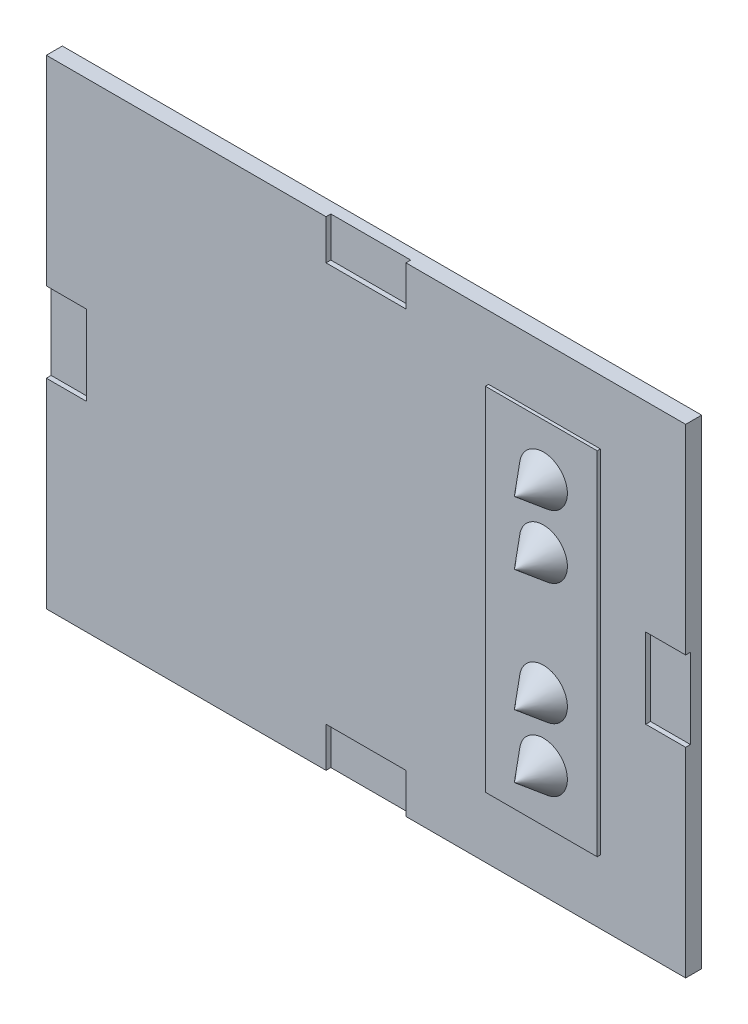
ISO-10303-21;
HEADER;
FILE_DESCRIPTION(('STEP AP214'),'2;1');
FILE_NAME('part.step','',(''),(''),'','','');
FILE_SCHEMA(('AUTOMOTIVE_DESIGN { 1 0 10303 214 1 1 1 1 }'));
ENDSEC;
DATA;
#1=APPLICATION_CONTEXT('core data for automotive mechanical design processes');
#2=APPLICATION_PROTOCOL_DEFINITION('international standard','automotive_design',2000,#1);
#3=PRODUCT_CONTEXT('',#1,'mechanical');
#4=PRODUCT('Part','Part','',(#3));
#5=PRODUCT_RELATED_PRODUCT_CATEGORY('part','',(#4));
#6=PRODUCT_DEFINITION_FORMATION('','',#4);
#7=PRODUCT_DEFINITION_CONTEXT('part definition',#1,'design');
#8=PRODUCT_DEFINITION('design','',#6,#7);
#9=PRODUCT_DEFINITION_SHAPE('','',#8);
#10=(LENGTH_UNIT() NAMED_UNIT(*) SI_UNIT(.MILLI.,.METRE.));
#11=(NAMED_UNIT(*) PLANE_ANGLE_UNIT() SI_UNIT($,.RADIAN.));
#12=(NAMED_UNIT(*) SI_UNIT($,.STERADIAN.) SOLID_ANGLE_UNIT());
#13=UNCERTAINTY_MEASURE_WITH_UNIT(LENGTH_MEASURE(1.E-05),#10,'distance_accuracy_value','');
#14=(GEOMETRIC_REPRESENTATION_CONTEXT(3) GLOBAL_UNCERTAINTY_ASSIGNED_CONTEXT((#13)) GLOBAL_UNIT_ASSIGNED_CONTEXT((#10,
#11,#12)) REPRESENTATION_CONTEXT('',''));
#15=CARTESIAN_POINT('',(0.,0.,0.));
#16=DIRECTION('',(0.,0.,1.));
#17=DIRECTION('',(1.,0.,0.));
#18=AXIS2_PLACEMENT_3D('',#15,#16,#17);
#19=CARTESIAN_POINT('',(-20.,15.,1.));
#20=DIRECTION('',(1.,0.,0.));
#21=DIRECTION('',(0.,0.,-1.));
#22=AXIS2_PLACEMENT_3D('',#19,#20,#21);
#23=PLANE('',#22);
#24=DIRECTION('',(0.,-1.,0.));
#25=VECTOR('',#24,1.);
#26=CARTESIAN_POINT('',(-20.,2.5,0.7));
#27=LINE('',#26,#25);
#28=CARTESIAN_POINT('',(-20.,2.5,0.7));
#29=VERTEX_POINT('',#28);
#30=CARTESIAN_POINT('',(-20.,-2.5,0.7));
#31=VERTEX_POINT('',#30);
#32=EDGE_CURVE('E200',#29,#31,#27,.T.);
#33=ORIENTED_EDGE('',*,*,#32,.F.);
#34=DIRECTION('',(0.,0.,1.));
#35=VECTOR('',#34,1.);
#36=CARTESIAN_POINT('',(-20.,2.5,0.7));
#37=LINE('',#36,#35);
#38=CARTESIAN_POINT('',(-20.,2.5,1.));
#39=VERTEX_POINT('',#38);
#40=EDGE_CURVE('E295',#29,#39,#37,.T.);
#41=ORIENTED_EDGE('',*,*,#40,.T.);
#42=DIRECTION('',(0.,-1.,0.));
#43=VECTOR('',#42,1.);
#44=CARTESIAN_POINT('',(-20.,15.,1.));
#45=LINE('',#44,#43);
#46=CARTESIAN_POINT('',(-20.,15.,1.));
#47=VERTEX_POINT('',#46);
#48=EDGE_CURVE('E341',#47,#39,#45,.T.);
#49=ORIENTED_EDGE('',*,*,#48,.F.);
#50=DIRECTION('',(0.,0.,-1.));
#51=VECTOR('',#50,1.);
#52=CARTESIAN_POINT('',(-20.,15.,1.));
#53=LINE('',#52,#51);
#54=CARTESIAN_POINT('',(-20.,15.,0.));
#55=VERTEX_POINT('',#54);
#56=EDGE_CURVE('E356',#47,#55,#53,.T.);
#57=ORIENTED_EDGE('',*,*,#56,.T.);
#58=DIRECTION('',(0.,-1.,0.));
#59=VECTOR('',#58,1.);
#60=CARTESIAN_POINT('',(-20.,15.,0.));
#61=LINE('',#60,#59);
#62=CARTESIAN_POINT('',(-20.,-15.,0.));
#63=VERTEX_POINT('',#62);
#64=EDGE_CURVE('E340',#55,#63,#61,.T.);
#65=ORIENTED_EDGE('',*,*,#64,.T.);
#66=DIRECTION('',(0.,0.,-1.));
#67=VECTOR('',#66,1.);
#68=CARTESIAN_POINT('',(-20.,-15.,1.));
#69=LINE('',#68,#67);
#70=CARTESIAN_POINT('',(-20.,-15.,1.));
#71=VERTEX_POINT('',#70);
#72=EDGE_CURVE('E373',#71,#63,#69,.T.);
#73=ORIENTED_EDGE('',*,*,#72,.F.);
#74=CARTESIAN_POINT('',(-20.,-2.5,1.));
#75=VERTEX_POINT('',#74);
#76=EDGE_CURVE('E213',#75,#71,#45,.T.);
#77=ORIENTED_EDGE('',*,*,#76,.F.);
#78=DIRECTION('',(0.,0.,1.));
#79=VECTOR('',#78,1.);
#80=CARTESIAN_POINT('',(-20.,-2.5,0.7));
#81=LINE('',#80,#79);
#82=EDGE_CURVE('E46',#31,#75,#81,.T.);
#83=ORIENTED_EDGE('',*,*,#82,.F.);
#84=EDGE_LOOP('',(#33,#41,#49,#57,#65,#73,#77,#83));
#85=FACE_BOUND('',#84,.T.);
#86=ADVANCED_FACE('F32',(#85),#23,.F.);
#87=CARTESIAN_POINT('',(-20.,-15.,1.));
#88=DIRECTION('',(0.,1.,0.));
#89=DIRECTION('',(0.,0.,1.));
#90=AXIS2_PLACEMENT_3D('',#87,#88,#89);
#91=PLANE('',#90);
#92=DIRECTION('',(1.,0.,0.));
#93=VECTOR('',#92,1.);
#94=CARTESIAN_POINT('',(-20.,-15.,1.));
#95=LINE('',#94,#93);
#96=CARTESIAN_POINT('',(2.5,-15.,1.));
#97=VERTEX_POINT('',#96);
#98=CARTESIAN_POINT('',(20.,-15.,1.));
#99=VERTEX_POINT('',#98);
#100=EDGE_CURVE('E344',#97,#99,#95,.T.);
#101=ORIENTED_EDGE('',*,*,#100,.F.);
#102=DIRECTION('',(0.,0.,1.));
#103=VECTOR('',#102,1.);
#104=CARTESIAN_POINT('',(2.5,-15.,0.7));
#105=LINE('',#104,#103);
#106=CARTESIAN_POINT('',(2.5,-15.,0.7));
#107=VERTEX_POINT('',#106);
#108=EDGE_CURVE('E299',#107,#97,#105,.T.);
#109=ORIENTED_EDGE('',*,*,#108,.F.);
#110=DIRECTION('',(1.,0.,0.));
#111=VECTOR('',#110,1.);
#112=CARTESIAN_POINT('',(-2.5,-15.,0.7));
#113=LINE('',#112,#111);
#114=CARTESIAN_POINT('',(-2.5,-15.,0.7));
#115=VERTEX_POINT('',#114);
#116=EDGE_CURVE('E288',#115,#107,#113,.T.);
#117=ORIENTED_EDGE('',*,*,#116,.F.);
#118=DIRECTION('',(0.,0.,1.));
#119=VECTOR('',#118,1.);
#120=CARTESIAN_POINT('',(-2.5,-15.,0.7));
#121=LINE('',#120,#119);
#122=CARTESIAN_POINT('',(-2.5,-15.,1.));
#123=VERTEX_POINT('',#122);
#124=EDGE_CURVE('E302',#115,#123,#121,.T.);
#125=ORIENTED_EDGE('',*,*,#124,.T.);
#126=EDGE_CURVE('E345',#71,#123,#95,.T.);
#127=ORIENTED_EDGE('',*,*,#126,.F.);
#128=ORIENTED_EDGE('',*,*,#72,.T.);
#129=DIRECTION('',(1.,0.,0.));
#130=VECTOR('',#129,1.);
#131=CARTESIAN_POINT('',(-20.,-15.,0.));
#132=LINE('',#131,#130);
#133=CARTESIAN_POINT('',(20.,-15.,0.));
#134=VERTEX_POINT('',#133);
#135=EDGE_CURVE('E359',#63,#134,#132,.T.);
#136=ORIENTED_EDGE('',*,*,#135,.T.);
#137=DIRECTION('',(0.,0.,-1.));
#138=VECTOR('',#137,1.);
#139=CARTESIAN_POINT('',(20.,-15.,1.));
#140=LINE('',#139,#138);
#141=EDGE_CURVE('E371',#99,#134,#140,.T.);
#142=ORIENTED_EDGE('',*,*,#141,.F.);
#143=EDGE_LOOP('',(#101,#109,#117,#125,#127,#128,#136,#142));
#144=FACE_BOUND('',#143,.T.);
#145=ADVANCED_FACE('F431',(#144),#91,.F.);
#146=CARTESIAN_POINT('',(20.,15.,1.));
#147=DIRECTION('',(1.,0.,0.));
#148=DIRECTION('',(0.,0.,-1.));
#149=AXIS2_PLACEMENT_3D('',#146,#147,#148);
#150=PLANE('',#149);
#151=DIRECTION('',(0.,0.,1.));
#152=VECTOR('',#151,1.);
#153=CARTESIAN_POINT('',(20.,-2.5,0.7));
#154=LINE('',#153,#152);
#155=CARTESIAN_POINT('',(20.,-2.5,0.7));
#156=VERTEX_POINT('',#155);
#157=CARTESIAN_POINT('',(20.,-2.5,1.));
#158=VERTEX_POINT('',#157);
#159=EDGE_CURVE('E237',#156,#158,#154,.T.);
#160=ORIENTED_EDGE('',*,*,#159,.T.);
#161=DIRECTION('',(0.,-1.,0.));
#162=VECTOR('',#161,1.);
#163=CARTESIAN_POINT('',(20.,15.,1.));
#164=LINE('',#163,#162);
#165=EDGE_CURVE('E348',#158,#99,#164,.T.);
#166=ORIENTED_EDGE('',*,*,#165,.T.);
#167=ORIENTED_EDGE('',*,*,#141,.T.);
#168=DIRECTION('',(0.,-1.,0.));
#169=VECTOR('',#168,1.);
#170=CARTESIAN_POINT('',(20.,15.,0.));
#171=LINE('',#170,#169);
#172=CARTESIAN_POINT('',(20.,15.,0.));
#173=VERTEX_POINT('',#172);
#174=EDGE_CURVE('E362',#173,#134,#171,.T.);
#175=ORIENTED_EDGE('',*,*,#174,.F.);
#176=DIRECTION('',(0.,0.,-1.));
#177=VECTOR('',#176,1.);
#178=CARTESIAN_POINT('',(20.,15.,1.));
#179=LINE('',#178,#177);
#180=CARTESIAN_POINT('',(20.,15.,1.));
#181=VERTEX_POINT('',#180);
#182=EDGE_CURVE('E369',#181,#173,#179,.T.);
#183=ORIENTED_EDGE('',*,*,#182,.F.);
#184=CARTESIAN_POINT('',(20.,2.5,1.));
#185=VERTEX_POINT('',#184);
#186=EDGE_CURVE('E349',#181,#185,#164,.T.);
#187=ORIENTED_EDGE('',*,*,#186,.T.);
#188=DIRECTION('',(0.,0.,1.));
#189=VECTOR('',#188,1.);
#190=CARTESIAN_POINT('',(20.,2.5,0.7));
#191=LINE('',#190,#189);
#192=CARTESIAN_POINT('',(20.,2.5,0.7));
#193=VERTEX_POINT('',#192);
#194=EDGE_CURVE('E262',#193,#185,#191,.T.);
#195=ORIENTED_EDGE('',*,*,#194,.F.);
#196=DIRECTION('',(0.,1.,0.));
#197=VECTOR('',#196,1.);
#198=CARTESIAN_POINT('',(20.,2.5,0.7));
#199=LINE('',#198,#197);
#200=EDGE_CURVE('E249',#156,#193,#199,.T.);
#201=ORIENTED_EDGE('',*,*,#200,.F.);
#202=EDGE_LOOP('',(#160,#166,#167,#175,#183,#187,#195,#201));
#203=FACE_BOUND('',#202,.T.);
#204=ADVANCED_FACE('F425',(#203),#150,.T.);
#205=CARTESIAN_POINT('',(-20.,15.,1.));
#206=DIRECTION('',(0.,1.,0.));
#207=DIRECTION('',(0.,0.,1.));
#208=AXIS2_PLACEMENT_3D('',#205,#206,#207);
#209=PLANE('',#208);
#210=DIRECTION('',(0.,0.,1.));
#211=VECTOR('',#210,1.);
#212=CARTESIAN_POINT('',(2.5,15.,0.7));
#213=LINE('',#212,#211);
#214=CARTESIAN_POINT('',(2.5,15.,0.7));
#215=VERTEX_POINT('',#214);
#216=CARTESIAN_POINT('',(2.5,15.,1.));
#217=VERTEX_POINT('',#216);
#218=EDGE_CURVE('E233',#215,#217,#213,.T.);
#219=ORIENTED_EDGE('',*,*,#218,.T.);
#220=DIRECTION('',(1.,0.,0.));
#221=VECTOR('',#220,1.);
#222=CARTESIAN_POINT('',(-20.,15.,1.));
#223=LINE('',#222,#221);
#224=EDGE_CURVE('E352',#217,#181,#223,.T.);
#225=ORIENTED_EDGE('',*,*,#224,.T.);
#226=ORIENTED_EDGE('',*,*,#182,.T.);
#227=DIRECTION('',(1.,0.,0.));
#228=VECTOR('',#227,1.);
#229=CARTESIAN_POINT('',(-20.,15.,0.));
#230=LINE('',#229,#228);
#231=EDGE_CURVE('E365',#55,#173,#230,.T.);
#232=ORIENTED_EDGE('',*,*,#231,.F.);
#233=ORIENTED_EDGE('',*,*,#56,.F.);
#234=CARTESIAN_POINT('',(-2.5,15.,1.));
#235=VERTEX_POINT('',#234);
#236=EDGE_CURVE('E353',#47,#235,#223,.T.);
#237=ORIENTED_EDGE('',*,*,#236,.T.);
#238=DIRECTION('',(0.,0.,1.));
#239=VECTOR('',#238,1.);
#240=CARTESIAN_POINT('',(-2.5,15.,0.7));
#241=LINE('',#240,#239);
#242=CARTESIAN_POINT('',(-2.5,15.,0.7));
#243=VERTEX_POINT('',#242);
#244=EDGE_CURVE('E54',#243,#235,#241,.T.);
#245=ORIENTED_EDGE('',*,*,#244,.F.);
#246=DIRECTION('',(-1.,0.,0.));
#247=VECTOR('',#246,1.);
#248=CARTESIAN_POINT('',(-2.5,15.,0.7));
#249=LINE('',#248,#247);
#250=EDGE_CURVE('E223',#215,#243,#249,.T.);
#251=ORIENTED_EDGE('',*,*,#250,.F.);
#252=EDGE_LOOP('',(#219,#225,#226,#232,#233,#237,#245,#251));
#253=FACE_BOUND('',#252,.T.);
#254=ADVANCED_FACE('F416',(#253),#209,.T.);
#255=CARTESIAN_POINT('',(0.,0.,1.));
#256=DIRECTION('',(0.,0.,1.));
#257=DIRECTION('',(1.,0.,0.));
#258=AXIS2_PLACEMENT_3D('',#255,#256,#257);
#259=PLANE('',#258);
#260=DIRECTION('',(-1.,0.,0.));
#261=VECTOR('',#260,1.);
#262=CARTESIAN_POINT('',(-17.5,2.5,1.));
#263=LINE('',#262,#261);
#264=CARTESIAN_POINT('',(-17.5,2.5,1.));
#265=VERTEX_POINT('',#264);
#266=EDGE_CURVE('E209',#265,#39,#263,.T.);
#267=ORIENTED_EDGE('',*,*,#266,.F.);
#268=DIRECTION('',(0.,1.,0.));
#269=VECTOR('',#268,1.);
#270=CARTESIAN_POINT('',(-17.5,2.5,1.));
#271=LINE('',#270,#269);
#272=CARTESIAN_POINT('',(-17.5,-2.5,1.));
#273=VERTEX_POINT('',#272);
#274=EDGE_CURVE('E462',#273,#265,#271,.T.);
#275=ORIENTED_EDGE('',*,*,#274,.F.);
#276=DIRECTION('',(1.,0.,0.));
#277=VECTOR('',#276,1.);
#278=CARTESIAN_POINT('',(-17.5,-2.5,1.));
#279=LINE('',#278,#277);
#280=EDGE_CURVE('E243',#75,#273,#279,.T.);
#281=ORIENTED_EDGE('',*,*,#280,.F.);
#282=ORIENTED_EDGE('',*,*,#76,.T.);
#283=ORIENTED_EDGE('',*,*,#126,.T.);
#284=DIRECTION('',(0.,-1.,0.));
#285=VECTOR('',#284,1.);
#286=CARTESIAN_POINT('',(-2.5,-12.5,1.));
#287=LINE('',#286,#285);
#288=CARTESIAN_POINT('',(-2.5,-12.5,1.));
#289=VERTEX_POINT('',#288);
#290=EDGE_CURVE('E282',#289,#123,#287,.T.);
#291=ORIENTED_EDGE('',*,*,#290,.F.);
#292=DIRECTION('',(-1.,0.,0.));
#293=VECTOR('',#292,1.);
#294=CARTESIAN_POINT('',(-2.5,-12.5,1.));
#295=LINE('',#294,#293);
#296=CARTESIAN_POINT('',(2.5,-12.5,1.));
#297=VERTEX_POINT('',#296);
#298=EDGE_CURVE('E294',#297,#289,#295,.T.);
#299=ORIENTED_EDGE('',*,*,#298,.F.);
#300=DIRECTION('',(0.,1.,0.));
#301=VECTOR('',#300,1.);
#302=CARTESIAN_POINT('',(2.5,-12.5,1.));
#303=LINE('',#302,#301);
#304=EDGE_CURVE('E292',#97,#297,#303,.T.);
#305=ORIENTED_EDGE('',*,*,#304,.F.);
#306=ORIENTED_EDGE('',*,*,#100,.T.);
#307=ORIENTED_EDGE('',*,*,#165,.F.);
#308=DIRECTION('',(1.,0.,0.));
#309=VECTOR('',#308,1.);
#310=CARTESIAN_POINT('',(17.5,-2.5,1.));
#311=LINE('',#310,#309);
#312=CARTESIAN_POINT('',(17.5,-2.5,1.));
#313=VERTEX_POINT('',#312);
#314=EDGE_CURVE('E253',#313,#158,#311,.T.);
#315=ORIENTED_EDGE('',*,*,#314,.F.);
#316=DIRECTION('',(0.,-1.,0.));
#317=VECTOR('',#316,1.);
#318=CARTESIAN_POINT('',(17.5,2.5,1.));
#319=LINE('',#318,#317);
#320=CARTESIAN_POINT('',(17.5,2.5,1.));
#321=VERTEX_POINT('',#320);
#322=EDGE_CURVE('E266',#321,#313,#319,.T.);
#323=ORIENTED_EDGE('',*,*,#322,.F.);
#324=DIRECTION('',(-1.,0.,0.));
#325=VECTOR('',#324,1.);
#326=CARTESIAN_POINT('',(17.5,2.5,1.));
#327=LINE('',#326,#325);
#328=EDGE_CURVE('E263',#185,#321,#327,.T.);
#329=ORIENTED_EDGE('',*,*,#328,.F.);
#330=ORIENTED_EDGE('',*,*,#186,.F.);
#331=ORIENTED_EDGE('',*,*,#224,.F.);
#332=DIRECTION('',(0.,1.,0.));
#333=VECTOR('',#332,1.);
#334=CARTESIAN_POINT('',(2.5,15.,1.));
#335=LINE('',#334,#333);
#336=CARTESIAN_POINT('',(2.5,12.5,1.));
#337=VERTEX_POINT('',#336);
#338=EDGE_CURVE('E234',#337,#217,#335,.T.);
#339=ORIENTED_EDGE('',*,*,#338,.F.);
#340=DIRECTION('',(1.,0.,0.));
#341=VECTOR('',#340,1.);
#342=CARTESIAN_POINT('',(-2.5,12.5,1.));
#343=LINE('',#342,#341);
#344=CARTESIAN_POINT('',(-2.5,12.5,1.));
#345=VERTEX_POINT('',#344);
#346=EDGE_CURVE('E224',#345,#337,#343,.T.);
#347=ORIENTED_EDGE('',*,*,#346,.F.);
#348=DIRECTION('',(0.,-1.,0.));
#349=VECTOR('',#348,1.);
#350=CARTESIAN_POINT('',(-2.5,15.,1.));
#351=LINE('',#350,#349);
#352=EDGE_CURVE('E236',#235,#345,#351,.T.);
#353=ORIENTED_EDGE('',*,*,#352,.F.);
#354=ORIENTED_EDGE('',*,*,#236,.F.);
#355=ORIENTED_EDGE('',*,*,#48,.T.);
#356=EDGE_LOOP('',(#267,#275,#281,#282,#283,#291,#299,#305,#306,#307,#315,#323,#329,#330,#331,
#339,#347,#353,#354,#355));
#357=FACE_BOUND('',#356,.T.);
#358=DIRECTION('',(-1.,0.,0.));
#359=VECTOR('',#358,1.);
#360=CARTESIAN_POINT('',(0.,11.,1.));
#361=LINE('',#360,#359);
#362=CARTESIAN_POINT('',(14.6666666666667,11.,1.));
#363=VERTEX_POINT('',#362);
#364=CARTESIAN_POINT('',(7.66666666666667,11.,1.));
#365=VERTEX_POINT('',#364);
#366=EDGE_CURVE('E337',#363,#365,#361,.T.);
#367=ORIENTED_EDGE('',*,*,#366,.F.);
#368=DIRECTION('',(0.,1.,0.));
#369=VECTOR('',#368,1.);
#370=CARTESIAN_POINT('',(14.6666666666667,0.,1.));
#371=LINE('',#370,#369);
#372=CARTESIAN_POINT('',(14.6666666666667,-11.,1.));
#373=VERTEX_POINT('',#372);
#374=EDGE_CURVE('E322',#373,#363,#371,.T.);
#375=ORIENTED_EDGE('',*,*,#374,.F.);
#376=DIRECTION('',(-1.,0.,0.));
#377=VECTOR('',#376,1.);
#378=CARTESIAN_POINT('',(0.,-11.,1.));
#379=LINE('',#378,#377);
#380=CARTESIAN_POINT('',(7.66666666666667,-11.,1.));
#381=VERTEX_POINT('',#380);
#382=EDGE_CURVE('E333',#373,#381,#379,.T.);
#383=ORIENTED_EDGE('',*,*,#382,.T.);
#384=DIRECTION('',(0.,1.,0.));
#385=VECTOR('',#384,1.);
#386=CARTESIAN_POINT('',(7.66666666666667,0.,1.));
#387=LINE('',#386,#385);
#388=EDGE_CURVE('E335',#381,#365,#387,.T.);
#389=ORIENTED_EDGE('',*,*,#388,.T.);
#390=EDGE_LOOP('',(#367,#375,#383,#389));
#391=FACE_BOUND('',#390,.T.);
#392=ADVANCED_FACE('F413',(#357,#391),#259,.T.);
#393=CARTESIAN_POINT('',(0.,0.,0.));
#394=DIRECTION('',(0.,0.,1.));
#395=DIRECTION('',(1.,0.,0.));
#396=AXIS2_PLACEMENT_3D('',#393,#394,#395);
#397=PLANE('',#396);
#398=ORIENTED_EDGE('',*,*,#64,.F.);
#399=ORIENTED_EDGE('',*,*,#231,.T.);
#400=ORIENTED_EDGE('',*,*,#174,.T.);
#401=ORIENTED_EDGE('',*,*,#135,.F.);
#402=EDGE_LOOP('',(#398,#399,#400,#401));
#403=FACE_BOUND('',#402,.T.);
#404=ADVANCED_FACE('F415',(#403),#397,.F.);
#405=CARTESIAN_POINT('',(7.66666666666667,11.,1.2));
#406=DIRECTION('',(0.,1.,0.));
#407=DIRECTION('',(-1.,0.,0.));
#408=AXIS2_PLACEMENT_3D('',#405,#406,#407);
#409=PLANE('',#408);
#410=DIRECTION('',(0.,0.,-1.));
#411=VECTOR('',#410,1.);
#412=CARTESIAN_POINT('',(14.6666666666667,11.,1.2));
#413=LINE('',#412,#411);
#414=CARTESIAN_POINT('',(14.6666666666667,11.,1.2));
#415=VERTEX_POINT('',#414);
#416=EDGE_CURVE('E318',#415,#363,#413,.T.);
#417=ORIENTED_EDGE('',*,*,#416,.T.);
#418=ORIENTED_EDGE('',*,*,#366,.T.);
#419=DIRECTION('',(0.,0.,-1.));
#420=VECTOR('',#419,1.);
#421=CARTESIAN_POINT('',(7.66666666666667,11.,1.2));
#422=LINE('',#421,#420);
#423=CARTESIAN_POINT('',(7.66666666666667,11.,1.2));
#424=VERTEX_POINT('',#423);
#425=EDGE_CURVE('E319',#424,#365,#422,.T.);
#426=ORIENTED_EDGE('',*,*,#425,.F.);
#427=DIRECTION('',(1.,0.,0.));
#428=VECTOR('',#427,1.);
#429=CARTESIAN_POINT('',(7.66666666666667,11.,1.2));
#430=LINE('',#429,#428);
#431=EDGE_CURVE('E301',#424,#415,#430,.T.);
#432=ORIENTED_EDGE('',*,*,#431,.T.);
#433=EDGE_LOOP('',(#417,#418,#426,#432));
#434=FACE_BOUND('',#433,.T.);
#435=ADVANCED_FACE('F402',(#434),#409,.T.);
#436=CARTESIAN_POINT('',(7.66666666666667,11.,1.2));
#437=DIRECTION('',(1.,0.,0.));
#438=DIRECTION('',(0.,1.,0.));
#439=AXIS2_PLACEMENT_3D('',#436,#437,#438);
#440=PLANE('',#439);
#441=ORIENTED_EDGE('',*,*,#388,.F.);
#442=DIRECTION('',(0.,0.,-1.));
#443=VECTOR('',#442,1.);
#444=CARTESIAN_POINT('',(7.66666666666667,-11.,1.2));
#445=LINE('',#444,#443);
#446=CARTESIAN_POINT('',(7.66666666666667,-11.,1.2));
#447=VERTEX_POINT('',#446);
#448=EDGE_CURVE('E323',#447,#381,#445,.T.);
#449=ORIENTED_EDGE('',*,*,#448,.F.);
#450=DIRECTION('',(0.,-1.,0.));
#451=VECTOR('',#450,1.);
#452=CARTESIAN_POINT('',(7.66666666666667,11.,1.2));
#453=LINE('',#452,#451);
#454=EDGE_CURVE('E316',#424,#447,#453,.T.);
#455=ORIENTED_EDGE('',*,*,#454,.F.);
#456=ORIENTED_EDGE('',*,*,#425,.T.);
#457=EDGE_LOOP('',(#441,#449,#455,#456));
#458=FACE_BOUND('',#457,.T.);
#459=ADVANCED_FACE('F405',(#458),#440,.F.);
#460=CARTESIAN_POINT('',(7.66666666666667,-11.,1.2));
#461=DIRECTION('',(0.,1.,0.));
#462=DIRECTION('',(-1.,0.,0.));
#463=AXIS2_PLACEMENT_3D('',#460,#461,#462);
#464=PLANE('',#463);
#465=ORIENTED_EDGE('',*,*,#382,.F.);
#466=DIRECTION('',(0.,0.,-1.));
#467=VECTOR('',#466,1.);
#468=CARTESIAN_POINT('',(14.6666666666667,-11.,1.2));
#469=LINE('',#468,#467);
#470=CARTESIAN_POINT('',(14.6666666666667,-11.,1.2));
#471=VERTEX_POINT('',#470);
#472=EDGE_CURVE('E326',#471,#373,#469,.T.);
#473=ORIENTED_EDGE('',*,*,#472,.F.);
#474=DIRECTION('',(1.,0.,0.));
#475=VECTOR('',#474,1.);
#476=CARTESIAN_POINT('',(7.66666666666667,-11.,1.2));
#477=LINE('',#476,#475);
#478=EDGE_CURVE('E314',#447,#471,#477,.T.);
#479=ORIENTED_EDGE('',*,*,#478,.F.);
#480=ORIENTED_EDGE('',*,*,#448,.T.);
#481=EDGE_LOOP('',(#465,#473,#479,#480));
#482=FACE_BOUND('',#481,.T.);
#483=ADVANCED_FACE('F410',(#482),#464,.F.);
#484=CARTESIAN_POINT('',(14.6666666666667,11.,1.2));
#485=DIRECTION('',(1.,0.,0.));
#486=DIRECTION('',(0.,1.,0.));
#487=AXIS2_PLACEMENT_3D('',#484,#485,#486);
#488=PLANE('',#487);
#489=ORIENTED_EDGE('',*,*,#472,.T.);
#490=ORIENTED_EDGE('',*,*,#374,.T.);
#491=ORIENTED_EDGE('',*,*,#416,.F.);
#492=DIRECTION('',(0.,-1.,0.));
#493=VECTOR('',#492,1.);
#494=CARTESIAN_POINT('',(14.6666666666667,11.,1.2));
#495=LINE('',#494,#493);
#496=EDGE_CURVE('E311',#415,#471,#495,.T.);
#497=ORIENTED_EDGE('',*,*,#496,.T.);
#498=EDGE_LOOP('',(#489,#490,#491,#497));
#499=FACE_BOUND('',#498,.T.);
#500=ADVANCED_FACE('F390',(#499),#488,.T.);
#501=CARTESIAN_POINT('',(0.,0.,1.2));
#502=DIRECTION('',(0.,0.,-1.));
#503=DIRECTION('',(-1.,0.,0.));
#504=AXIS2_PLACEMENT_3D('',#501,#502,#503);
#505=PLANE('',#504);
#506=CARTESIAN_POINT('',(11.3,7.75,1.2));
#507=DIRECTION('',(0.,0.,-1.));
#508=DIRECTION('',(-1.,0.,0.));
#509=AXIS2_PLACEMENT_3D('',#506,#507,#508);
#510=CIRCLE('',#509,1.5);
#511=CARTESIAN_POINT('',(9.8,7.75,1.2));
#512=VERTEX_POINT('',#511);
#513=EDGE_CURVE('E11',#512,#512,#510,.F.);
#514=ORIENTED_EDGE('',*,*,#513,.F.);
#515=EDGE_LOOP('',(#514));
#516=FACE_BOUND('',#515,.T.);
#517=CARTESIAN_POINT('',(11.3,3.8,1.2));
#518=DIRECTION('',(0.,0.,-1.));
#519=DIRECTION('',(-1.,0.,0.));
#520=AXIS2_PLACEMENT_3D('',#517,#518,#519);
#521=CIRCLE('',#520,1.5);
#522=CARTESIAN_POINT('',(9.8,3.8,1.2));
#523=VERTEX_POINT('',#522);
#524=EDGE_CURVE('E39',#523,#523,#521,.F.);
#525=ORIENTED_EDGE('',*,*,#524,.F.);
#526=EDGE_LOOP('',(#525));
#527=FACE_BOUND('',#526,.T.);
#528=CARTESIAN_POINT('',(11.3,-3.8,1.2));
#529=DIRECTION('',(0.,0.,-1.));
#530=DIRECTION('',(-1.,0.,0.));
#531=AXIS2_PLACEMENT_3D('',#528,#529,#530);
#532=CIRCLE('',#531,1.5);
#533=CARTESIAN_POINT('',(9.8,-3.8,1.2));
#534=VERTEX_POINT('',#533);
#535=EDGE_CURVE('E379',#534,#534,#532,.F.);
#536=ORIENTED_EDGE('',*,*,#535,.F.);
#537=EDGE_LOOP('',(#536));
#538=FACE_BOUND('',#537,.T.);
#539=CARTESIAN_POINT('',(11.3,-7.75,1.2));
#540=DIRECTION('',(0.,0.,-1.));
#541=DIRECTION('',(-1.,0.,0.));
#542=AXIS2_PLACEMENT_3D('',#539,#540,#541);
#543=CIRCLE('',#542,1.5);
#544=CARTESIAN_POINT('',(9.8,-7.75,1.2));
#545=VERTEX_POINT('',#544);
#546=EDGE_CURVE('E376',#545,#545,#543,.F.);
#547=ORIENTED_EDGE('',*,*,#546,.F.);
#548=EDGE_LOOP('',(#547));
#549=FACE_BOUND('',#548,.T.);
#550=ORIENTED_EDGE('',*,*,#431,.F.);
#551=ORIENTED_EDGE('',*,*,#454,.T.);
#552=ORIENTED_EDGE('',*,*,#478,.T.);
#553=ORIENTED_EDGE('',*,*,#496,.F.);
#554=EDGE_LOOP('',(#550,#551,#552,#553));
#555=FACE_BOUND('',#554,.T.);
#556=ADVANCED_FACE('F386',(#516,#527,#538,#549,#555),#505,.F.);
#557=CARTESIAN_POINT('',(2.5,-12.5,0.7));
#558=DIRECTION('',(1.,0.,0.));
#559=DIRECTION('',(0.,0.,-1.));
#560=AXIS2_PLACEMENT_3D('',#557,#558,#559);
#561=PLANE('',#560);
#562=ORIENTED_EDGE('',*,*,#304,.T.);
#563=DIRECTION('',(0.,0.,1.));
#564=VECTOR('',#563,1.);
#565=CARTESIAN_POINT('',(2.5,-12.5,0.7));
#566=LINE('',#565,#564);
#567=CARTESIAN_POINT('',(2.5,-12.5,0.7));
#568=VERTEX_POINT('',#567);
#569=EDGE_CURVE('E291',#568,#297,#566,.T.);
#570=ORIENTED_EDGE('',*,*,#569,.F.);
#571=DIRECTION('',(0.,1.,0.));
#572=VECTOR('',#571,1.);
#573=CARTESIAN_POINT('',(2.5,-12.5,0.7));
#574=LINE('',#573,#572);
#575=EDGE_CURVE('E278',#107,#568,#574,.T.);
#576=ORIENTED_EDGE('',*,*,#575,.F.);
#577=ORIENTED_EDGE('',*,*,#108,.T.);
#578=EDGE_LOOP('',(#562,#570,#576,#577));
#579=FACE_BOUND('',#578,.T.);
#580=ADVANCED_FACE('F389',(#579),#561,.F.);
#581=CARTESIAN_POINT('',(-2.5,-12.5,0.7));
#582=DIRECTION('',(-1.,0.,0.));
#583=DIRECTION('',(0.,0.,1.));
#584=AXIS2_PLACEMENT_3D('',#581,#582,#583);
#585=PLANE('',#584);
#586=ORIENTED_EDGE('',*,*,#290,.T.);
#587=ORIENTED_EDGE('',*,*,#124,.F.);
#588=DIRECTION('',(0.,-1.,0.));
#589=VECTOR('',#588,1.);
#590=CARTESIAN_POINT('',(-2.5,-12.5,0.7));
#591=LINE('',#590,#589);
#592=CARTESIAN_POINT('',(-2.5,-12.5,0.7));
#593=VERTEX_POINT('',#592);
#594=EDGE_CURVE('E285',#593,#115,#591,.T.);
#595=ORIENTED_EDGE('',*,*,#594,.F.);
#596=DIRECTION('',(0.,0.,1.));
#597=VECTOR('',#596,1.);
#598=CARTESIAN_POINT('',(-2.5,-12.5,0.7));
#599=LINE('',#598,#597);
#600=EDGE_CURVE('E305',#593,#289,#599,.T.);
#601=ORIENTED_EDGE('',*,*,#600,.T.);
#602=EDGE_LOOP('',(#586,#587,#595,#601));
#603=FACE_BOUND('',#602,.T.);
#604=ADVANCED_FACE('F507',(#603),#585,.F.);
#605=CARTESIAN_POINT('',(-2.5,-12.5,0.7));
#606=DIRECTION('',(0.,1.,0.));
#607=DIRECTION('',(0.,0.,1.));
#608=AXIS2_PLACEMENT_3D('',#605,#606,#607);
#609=PLANE('',#608);
#610=ORIENTED_EDGE('',*,*,#298,.T.);
#611=ORIENTED_EDGE('',*,*,#600,.F.);
#612=DIRECTION('',(-1.,0.,0.));
#613=VECTOR('',#612,1.);
#614=CARTESIAN_POINT('',(-2.5,-12.5,0.7));
#615=LINE('',#614,#613);
#616=EDGE_CURVE('E281',#568,#593,#615,.T.);
#617=ORIENTED_EDGE('',*,*,#616,.F.);
#618=ORIENTED_EDGE('',*,*,#569,.T.);
#619=EDGE_LOOP('',(#610,#611,#617,#618));
#620=FACE_BOUND('',#619,.T.);
#621=ADVANCED_FACE('F454',(#620),#609,.F.);
#622=CARTESIAN_POINT('',(0.,0.,0.7));
#623=DIRECTION('',(0.,0.,1.));
#624=DIRECTION('',(1.,0.,0.));
#625=AXIS2_PLACEMENT_3D('',#622,#623,#624);
#626=PLANE('',#625);
#627=ORIENTED_EDGE('',*,*,#575,.T.);
#628=ORIENTED_EDGE('',*,*,#616,.T.);
#629=ORIENTED_EDGE('',*,*,#594,.T.);
#630=ORIENTED_EDGE('',*,*,#116,.T.);
#631=EDGE_LOOP('',(#627,#628,#629,#630));
#632=FACE_BOUND('',#631,.T.);
#633=ADVANCED_FACE('F457',(#632),#626,.T.);
#634=CARTESIAN_POINT('',(17.5,-2.5,0.7));
#635=DIRECTION('',(0.,-1.,0.));
#636=DIRECTION('',(0.,0.,-1.));
#637=AXIS2_PLACEMENT_3D('',#634,#635,#636);
#638=PLANE('',#637);
#639=ORIENTED_EDGE('',*,*,#314,.T.);
#640=ORIENTED_EDGE('',*,*,#159,.F.);
#641=DIRECTION('',(1.,0.,0.));
#642=VECTOR('',#641,1.);
#643=CARTESIAN_POINT('',(17.5,-2.5,0.7));
#644=LINE('',#643,#642);
#645=CARTESIAN_POINT('',(17.5,-2.5,0.7));
#646=VERTEX_POINT('',#645);
#647=EDGE_CURVE('E259',#646,#156,#644,.T.);
#648=ORIENTED_EDGE('',*,*,#647,.F.);
#649=DIRECTION('',(0.,0.,1.));
#650=VECTOR('',#649,1.);
#651=CARTESIAN_POINT('',(17.5,-2.5,0.7));
#652=LINE('',#651,#650);
#653=EDGE_CURVE('E273',#646,#313,#652,.T.);
#654=ORIENTED_EDGE('',*,*,#653,.T.);
#655=EDGE_LOOP('',(#639,#640,#648,#654));
#656=FACE_BOUND('',#655,.T.);
#657=ADVANCED_FACE('F484',(#656),#638,.F.);
#658=CARTESIAN_POINT('',(17.5,2.5,0.7));
#659=DIRECTION('',(-1.,0.,0.));
#660=DIRECTION('',(0.,0.,1.));
#661=AXIS2_PLACEMENT_3D('',#658,#659,#660);
#662=PLANE('',#661);
#663=ORIENTED_EDGE('',*,*,#322,.T.);
#664=ORIENTED_EDGE('',*,*,#653,.F.);
#665=DIRECTION('',(0.,-1.,0.));
#666=VECTOR('',#665,1.);
#667=CARTESIAN_POINT('',(17.5,2.5,0.7));
#668=LINE('',#667,#666);
#669=CARTESIAN_POINT('',(17.5,2.5,0.7));
#670=VERTEX_POINT('',#669);
#671=EDGE_CURVE('E256',#670,#646,#668,.T.);
#672=ORIENTED_EDGE('',*,*,#671,.F.);
#673=DIRECTION('',(0.,0.,1.));
#674=VECTOR('',#673,1.);
#675=CARTESIAN_POINT('',(17.5,2.5,0.7));
#676=LINE('',#675,#674);
#677=EDGE_CURVE('E275',#670,#321,#676,.T.);
#678=ORIENTED_EDGE('',*,*,#677,.T.);
#679=EDGE_LOOP('',(#663,#664,#672,#678));
#680=FACE_BOUND('',#679,.T.);
#681=ADVANCED_FACE('F489',(#680),#662,.F.);
#682=CARTESIAN_POINT('',(17.5,2.5,0.7));
#683=DIRECTION('',(0.,1.,0.));
#684=DIRECTION('',(0.,0.,1.));
#685=AXIS2_PLACEMENT_3D('',#682,#683,#684);
#686=PLANE('',#685);
#687=ORIENTED_EDGE('',*,*,#328,.T.);
#688=ORIENTED_EDGE('',*,*,#677,.F.);
#689=DIRECTION('',(-1.,0.,0.));
#690=VECTOR('',#689,1.);
#691=CARTESIAN_POINT('',(17.5,2.5,0.7));
#692=LINE('',#691,#690);
#693=EDGE_CURVE('E252',#193,#670,#692,.T.);
#694=ORIENTED_EDGE('',*,*,#693,.F.);
#695=ORIENTED_EDGE('',*,*,#194,.T.);
#696=EDGE_LOOP('',(#687,#688,#694,#695));
#697=FACE_BOUND('',#696,.T.);
#698=ADVANCED_FACE('F493',(#697),#686,.F.);
#699=CARTESIAN_POINT('',(0.,0.,0.7));
#700=DIRECTION('',(0.,0.,1.));
#701=DIRECTION('',(1.,0.,0.));
#702=AXIS2_PLACEMENT_3D('',#699,#700,#701);
#703=PLANE('',#702);
#704=ORIENTED_EDGE('',*,*,#200,.T.);
#705=ORIENTED_EDGE('',*,*,#693,.T.);
#706=ORIENTED_EDGE('',*,*,#671,.T.);
#707=ORIENTED_EDGE('',*,*,#647,.T.);
#708=EDGE_LOOP('',(#704,#705,#706,#707));
#709=FACE_BOUND('',#708,.T.);
#710=ADVANCED_FACE('F486',(#709),#703,.T.);
#711=CARTESIAN_POINT('',(2.5,15.,0.7));
#712=DIRECTION('',(1.,0.,0.));
#713=DIRECTION('',(0.,1.,0.));
#714=AXIS2_PLACEMENT_3D('',#711,#712,#713);
#715=PLANE('',#714);
#716=ORIENTED_EDGE('',*,*,#338,.T.);
#717=ORIENTED_EDGE('',*,*,#218,.F.);
#718=DIRECTION('',(0.,1.,0.));
#719=VECTOR('',#718,1.);
#720=CARTESIAN_POINT('',(2.5,15.,0.7));
#721=LINE('',#720,#719);
#722=CARTESIAN_POINT('',(2.5,12.5,0.7));
#723=VERTEX_POINT('',#722);
#724=EDGE_CURVE('E220',#723,#215,#721,.T.);
#725=ORIENTED_EDGE('',*,*,#724,.F.);
#726=DIRECTION('',(0.,0.,1.));
#727=VECTOR('',#726,1.);
#728=CARTESIAN_POINT('',(2.5,12.5,0.7));
#729=LINE('',#728,#727);
#730=EDGE_CURVE('E241',#723,#337,#729,.T.);
#731=ORIENTED_EDGE('',*,*,#730,.T.);
#732=EDGE_LOOP('',(#716,#717,#725,#731));
#733=FACE_BOUND('',#732,.T.);
#734=ADVANCED_FACE('F500',(#733),#715,.F.);
#735=CARTESIAN_POINT('',(-2.5,12.5,0.7));
#736=DIRECTION('',(0.,-1.,0.));
#737=DIRECTION('',(0.,0.,-1.));
#738=AXIS2_PLACEMENT_3D('',#735,#736,#737);
#739=PLANE('',#738);
#740=ORIENTED_EDGE('',*,*,#346,.T.);
#741=ORIENTED_EDGE('',*,*,#730,.F.);
#742=DIRECTION('',(1.,0.,0.));
#743=VECTOR('',#742,1.);
#744=CARTESIAN_POINT('',(-2.5,12.5,0.7));
#745=LINE('',#744,#743);
#746=CARTESIAN_POINT('',(-2.5,12.5,0.7));
#747=VERTEX_POINT('',#746);
#748=EDGE_CURVE('E230',#747,#723,#745,.T.);
#749=ORIENTED_EDGE('',*,*,#748,.F.);
#750=DIRECTION('',(0.,0.,1.));
#751=VECTOR('',#750,1.);
#752=CARTESIAN_POINT('',(-2.5,12.5,0.7));
#753=LINE('',#752,#751);
#754=EDGE_CURVE('E244',#747,#345,#753,.T.);
#755=ORIENTED_EDGE('',*,*,#754,.T.);
#756=EDGE_LOOP('',(#740,#741,#749,#755));
#757=FACE_BOUND('',#756,.T.);
#758=ADVANCED_FACE('F586',(#757),#739,.F.);
#759=CARTESIAN_POINT('',(-2.5,15.,0.7));
#760=DIRECTION('',(-1.,0.,0.));
#761=DIRECTION('',(0.,0.,1.));
#762=AXIS2_PLACEMENT_3D('',#759,#760,#761);
#763=PLANE('',#762);
#764=ORIENTED_EDGE('',*,*,#352,.T.);
#765=ORIENTED_EDGE('',*,*,#754,.F.);
#766=DIRECTION('',(0.,-1.,0.));
#767=VECTOR('',#766,1.);
#768=CARTESIAN_POINT('',(-2.5,15.,0.7));
#769=LINE('',#768,#767);
#770=EDGE_CURVE('E227',#243,#747,#769,.T.);
#771=ORIENTED_EDGE('',*,*,#770,.F.);
#772=ORIENTED_EDGE('',*,*,#244,.T.);
#773=EDGE_LOOP('',(#764,#765,#771,#772));
#774=FACE_BOUND('',#773,.T.);
#775=ADVANCED_FACE('F596',(#774),#763,.F.);
#776=CARTESIAN_POINT('',(0.,0.,0.7));
#777=DIRECTION('',(0.,0.,1.));
#778=DIRECTION('',(1.,0.,0.));
#779=AXIS2_PLACEMENT_3D('',#776,#777,#778);
#780=PLANE('',#779);
#781=ORIENTED_EDGE('',*,*,#724,.T.);
#782=ORIENTED_EDGE('',*,*,#250,.T.);
#783=ORIENTED_EDGE('',*,*,#770,.T.);
#784=ORIENTED_EDGE('',*,*,#748,.T.);
#785=EDGE_LOOP('',(#781,#782,#783,#784));
#786=FACE_BOUND('',#785,.T.);
#787=ADVANCED_FACE('F606',(#786),#780,.T.);
#788=CARTESIAN_POINT('',(-17.5,2.5,0.7));
#789=DIRECTION('',(0.,1.,0.));
#790=DIRECTION('',(0.,0.,1.));
#791=AXIS2_PLACEMENT_3D('',#788,#789,#790);
#792=PLANE('',#791);
#793=ORIENTED_EDGE('',*,*,#266,.T.);
#794=ORIENTED_EDGE('',*,*,#40,.F.);
#795=DIRECTION('',(-1.,0.,0.));
#796=VECTOR('',#795,1.);
#797=CARTESIAN_POINT('',(-17.5,2.5,0.7));
#798=LINE('',#797,#796);
#799=CARTESIAN_POINT('',(-17.5,2.5,0.7));
#800=VERTEX_POINT('',#799);
#801=EDGE_CURVE('E206',#800,#29,#798,.T.);
#802=ORIENTED_EDGE('',*,*,#801,.F.);
#803=DIRECTION('',(0.,0.,1.));
#804=VECTOR('',#803,1.);
#805=CARTESIAN_POINT('',(-17.5,2.5,0.7));
#806=LINE('',#805,#804);
#807=EDGE_CURVE('E215',#800,#265,#806,.T.);
#808=ORIENTED_EDGE('',*,*,#807,.T.);
#809=EDGE_LOOP('',(#793,#794,#802,#808));
#810=FACE_BOUND('',#809,.T.);
#811=ADVANCED_FACE('F469',(#810),#792,.F.);
#812=CARTESIAN_POINT('',(-17.5,2.5,0.7));
#813=DIRECTION('',(1.,0.,0.));
#814=DIRECTION('',(0.,0.,-1.));
#815=AXIS2_PLACEMENT_3D('',#812,#813,#814);
#816=PLANE('',#815);
#817=ORIENTED_EDGE('',*,*,#274,.T.);
#818=ORIENTED_EDGE('',*,*,#807,.F.);
#819=DIRECTION('',(0.,1.,0.));
#820=VECTOR('',#819,1.);
#821=CARTESIAN_POINT('',(-17.5,2.5,0.7));
#822=LINE('',#821,#820);
#823=CARTESIAN_POINT('',(-17.5,-2.5,0.7));
#824=VERTEX_POINT('',#823);
#825=EDGE_CURVE('E199',#824,#800,#822,.T.);
#826=ORIENTED_EDGE('',*,*,#825,.F.);
#827=DIRECTION('',(0.,0.,1.));
#828=VECTOR('',#827,1.);
#829=CARTESIAN_POINT('',(-17.5,-2.5,0.7));
#830=LINE('',#829,#828);
#831=EDGE_CURVE('E195',#824,#273,#830,.T.);
#832=ORIENTED_EDGE('',*,*,#831,.T.);
#833=EDGE_LOOP('',(#817,#818,#826,#832));
#834=FACE_BOUND('',#833,.T.);
#835=ADVANCED_FACE('F471',(#834),#816,.F.);
#836=CARTESIAN_POINT('',(-17.5,-2.5,0.7));
#837=DIRECTION('',(0.,-1.,0.));
#838=DIRECTION('',(0.,0.,-1.));
#839=AXIS2_PLACEMENT_3D('',#836,#837,#838);
#840=PLANE('',#839);
#841=ORIENTED_EDGE('',*,*,#280,.T.);
#842=ORIENTED_EDGE('',*,*,#831,.F.);
#843=DIRECTION('',(1.,0.,0.));
#844=VECTOR('',#843,1.);
#845=CARTESIAN_POINT('',(-17.5,-2.5,0.7));
#846=LINE('',#845,#844);
#847=EDGE_CURVE('E192',#31,#824,#846,.T.);
#848=ORIENTED_EDGE('',*,*,#847,.F.);
#849=ORIENTED_EDGE('',*,*,#82,.T.);
#850=EDGE_LOOP('',(#841,#842,#848,#849));
#851=FACE_BOUND('',#850,.T.);
#852=ADVANCED_FACE('F194',(#851),#840,.F.);
#853=CARTESIAN_POINT('',(0.,0.,0.7));
#854=DIRECTION('',(0.,0.,-1.));
#855=DIRECTION('',(-1.,0.,0.));
#856=AXIS2_PLACEMENT_3D('',#853,#854,#855);
#857=PLANE('',#856);
#858=ORIENTED_EDGE('',*,*,#32,.T.);
#859=ORIENTED_EDGE('',*,*,#847,.T.);
#860=ORIENTED_EDGE('',*,*,#825,.T.);
#861=ORIENTED_EDGE('',*,*,#801,.T.);
#862=EDGE_LOOP('',(#858,#859,#860,#861));
#863=FACE_BOUND('',#862,.T.);
#864=ADVANCED_FACE('F204',(#863),#857,.F.);
#865=CARTESIAN_POINT('',(11.3,-7.75,1.2));
#866=DIRECTION('',(0.,0.,-1.));
#867=DIRECTION('',(1.,0.,0.));
#868=AXIS2_PLACEMENT_3D('',#865,#866,#867);
#869=CONICAL_SURFACE('',#868,1.5,0.689405054537762);
#870=CARTESIAN_POINT('',(11.3,-7.75,3.));
#871=DIRECTION('',(0.,0.,1.));
#872=DIRECTION('',(1.,0.,0.));
#873=AXIS2_PLACEMENT_3D('',#870,#871,#872);
#874=CIRCLE('',#873,0.0161945055285037);
#875=CARTESIAN_POINT('',(11.3161945055285,-7.75,3.));
#876=VERTEX_POINT('',#875);
#877=EDGE_CURVE('E267',#876,#876,#874,.T.);
#878=ORIENTED_EDGE('',*,*,#877,.F.);
#879=EDGE_LOOP('',(#878));
#880=FACE_BOUND('',#879,.T.);
#881=ORIENTED_EDGE('',*,*,#546,.T.);
#882=EDGE_LOOP('',(#881));
#883=FACE_BOUND('',#882,.T.);
#884=ADVANCED_FACE('F646',(#880,#883),#869,.T.);
#885=CARTESIAN_POINT('',(11.3,-7.75,3.));
#886=DIRECTION('',(0.,0.,1.));
#887=DIRECTION('',(1.,0.,0.));
#888=AXIS2_PLACEMENT_3D('',#885,#886,#887);
#889=PLANE('',#888);
#890=ORIENTED_EDGE('',*,*,#877,.T.);
#891=EDGE_LOOP('',(#890));
#892=FACE_BOUND('',#891,.T.);
#893=ADVANCED_FACE('F655',(#892),#889,.T.);
#894=CARTESIAN_POINT('',(11.3,-3.8,1.2));
#895=DIRECTION('',(0.,0.,-1.));
#896=DIRECTION('',(1.,0.,0.));
#897=AXIS2_PLACEMENT_3D('',#894,#895,#896);
#898=CONICAL_SURFACE('',#897,1.5,0.689405054537762);
#899=CARTESIAN_POINT('',(11.3,-3.8,3.));
#900=DIRECTION('',(0.,0.,1.));
#901=DIRECTION('',(1.,0.,0.));
#902=AXIS2_PLACEMENT_3D('',#899,#900,#901);
#903=CIRCLE('',#902,0.0161945055285035);
#904=CARTESIAN_POINT('',(11.3161945055285,-3.8,3.));
#905=VERTEX_POINT('',#904);
#906=EDGE_CURVE('E734',#905,#905,#903,.T.);
#907=ORIENTED_EDGE('',*,*,#906,.F.);
#908=EDGE_LOOP('',(#907));
#909=FACE_BOUND('',#908,.T.);
#910=ORIENTED_EDGE('',*,*,#535,.T.);
#911=EDGE_LOOP('',(#910));
#912=FACE_BOUND('',#911,.T.);
#913=ADVANCED_FACE('F662',(#909,#912),#898,.T.);
#914=CARTESIAN_POINT('',(11.3,-3.8,3.));
#915=DIRECTION('',(0.,0.,1.));
#916=DIRECTION('',(1.,0.,0.));
#917=AXIS2_PLACEMENT_3D('',#914,#915,#916);
#918=PLANE('',#917);
#919=ORIENTED_EDGE('',*,*,#906,.T.);
#920=EDGE_LOOP('',(#919));
#921=FACE_BOUND('',#920,.T.);
#922=ADVANCED_FACE('F670',(#921),#918,.T.);
#923=CARTESIAN_POINT('',(11.3,3.8,1.2));
#924=DIRECTION('',(0.,0.,-1.));
#925=DIRECTION('',(1.,0.,0.));
#926=AXIS2_PLACEMENT_3D('',#923,#924,#925);
#927=CONICAL_SURFACE('',#926,1.5,0.689405054537762);
#928=CARTESIAN_POINT('',(11.3,3.8,3.));
#929=DIRECTION('',(0.,0.,1.));
#930=DIRECTION('',(1.,0.,0.));
#931=AXIS2_PLACEMENT_3D('',#928,#929,#930);
#932=CIRCLE('',#931,0.0161945055285037);
#933=CARTESIAN_POINT('',(11.3161945055285,3.8,3.));
#934=VERTEX_POINT('',#933);
#935=EDGE_CURVE('E731',#934,#934,#932,.T.);
#936=ORIENTED_EDGE('',*,*,#935,.F.);
#937=EDGE_LOOP('',(#936));
#938=FACE_BOUND('',#937,.T.);
#939=ORIENTED_EDGE('',*,*,#524,.T.);
#940=EDGE_LOOP('',(#939));
#941=FACE_BOUND('',#940,.T.);
#942=ADVANCED_FACE('F384',(#938,#941),#927,.T.);
#943=CARTESIAN_POINT('',(11.3,3.8,3.));
#944=DIRECTION('',(0.,0.,1.));
#945=DIRECTION('',(1.,0.,0.));
#946=AXIS2_PLACEMENT_3D('',#943,#944,#945);
#947=PLANE('',#946);
#948=ORIENTED_EDGE('',*,*,#935,.T.);
#949=EDGE_LOOP('',(#948));
#950=FACE_BOUND('',#949,.T.);
#951=ADVANCED_FACE('F685',(#950),#947,.T.);
#952=CARTESIAN_POINT('',(11.3,7.75,1.2));
#953=DIRECTION('',(0.,0.,-1.));
#954=DIRECTION('',(1.,0.,0.));
#955=AXIS2_PLACEMENT_3D('',#952,#953,#954);
#956=CONICAL_SURFACE('',#955,1.5,0.689405054537762);
#957=CARTESIAN_POINT('',(11.3,7.75,3.));
#958=DIRECTION('',(0.,0.,1.));
#959=DIRECTION('',(1.,0.,0.));
#960=AXIS2_PLACEMENT_3D('',#957,#958,#959);
#961=CIRCLE('',#960,0.0161945055285035);
#962=CARTESIAN_POINT('',(11.3161945055285,7.75,3.));
#963=VERTEX_POINT('',#962);
#964=EDGE_CURVE('E730',#963,#963,#961,.T.);
#965=ORIENTED_EDGE('',*,*,#964,.F.);
#966=EDGE_LOOP('',(#965));
#967=FACE_BOUND('',#966,.T.);
#968=ORIENTED_EDGE('',*,*,#513,.T.);
#969=EDGE_LOOP('',(#968));
#970=FACE_BOUND('',#969,.T.);
#971=ADVANCED_FACE('F693',(#967,#970),#956,.T.);
#972=CARTESIAN_POINT('',(11.3,7.75,3.));
#973=DIRECTION('',(0.,0.,1.));
#974=DIRECTION('',(1.,0.,0.));
#975=AXIS2_PLACEMENT_3D('',#972,#973,#974);
#976=PLANE('',#975);
#977=ORIENTED_EDGE('',*,*,#964,.T.);
#978=EDGE_LOOP('',(#977));
#979=FACE_BOUND('',#978,.T.);
#980=ADVANCED_FACE('F701',(#979),#976,.T.);
#981=CLOSED_SHELL('',(#86,#145,#204,#254,#392,#404,#435,#459,#483,#500,#556,#580,#604,#621,#633,
#657,#681,#698,#710,#734,#758,#775,#787,#811,#835,#852,#864,#884,#893,#913,#922,#942,#951,#971,#980));
#982=MANIFOLD_SOLID_BREP('B2',#981);
#983=ADVANCED_BREP_SHAPE_REPRESENTATION('',(#18,#982),#14);
#984=SHAPE_DEFINITION_REPRESENTATION(#9,#983);
ENDSEC;
END-ISO-10303-21;
